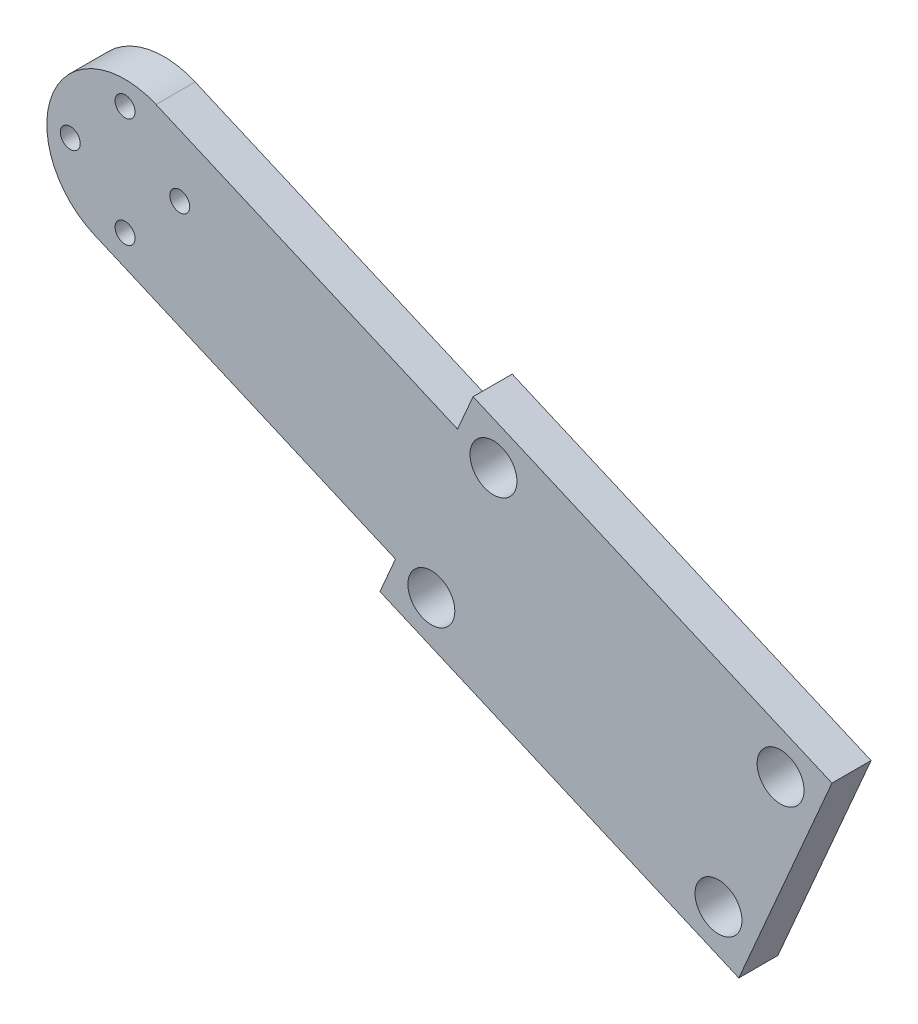
ISO-10303-21;
HEADER;
FILE_DESCRIPTION(('STEP AP214'),'2;1');
FILE_NAME('part.step','',(''),(''),'','','');
FILE_SCHEMA(('AUTOMOTIVE_DESIGN { 1 0 10303 214 1 1 1 1 }'));
ENDSEC;
DATA;
#1=APPLICATION_CONTEXT('core data for automotive mechanical design processes');
#2=APPLICATION_PROTOCOL_DEFINITION('international standard','automotive_design',2000,#1);
#3=PRODUCT_CONTEXT('',#1,'mechanical');
#4=PRODUCT('Part','Part','',(#3));
#5=PRODUCT_RELATED_PRODUCT_CATEGORY('part','',(#4));
#6=PRODUCT_DEFINITION_FORMATION('','',#4);
#7=PRODUCT_DEFINITION_CONTEXT('part definition',#1,'design');
#8=PRODUCT_DEFINITION('design','',#6,#7);
#9=PRODUCT_DEFINITION_SHAPE('','',#8);
#10=(LENGTH_UNIT() NAMED_UNIT(*) SI_UNIT(.MILLI.,.METRE.));
#11=(NAMED_UNIT(*) PLANE_ANGLE_UNIT() SI_UNIT($,.RADIAN.));
#12=(NAMED_UNIT(*) SI_UNIT($,.STERADIAN.) SOLID_ANGLE_UNIT());
#13=UNCERTAINTY_MEASURE_WITH_UNIT(LENGTH_MEASURE(1.E-05),#10,'distance_accuracy_value','');
#14=(GEOMETRIC_REPRESENTATION_CONTEXT(3) GLOBAL_UNCERTAINTY_ASSIGNED_CONTEXT((#13)) GLOBAL_UNIT_ASSIGNED_CONTEXT((#10,
#11,#12)) REPRESENTATION_CONTEXT('',''));
#15=CARTESIAN_POINT('',(0.,0.,0.));
#16=DIRECTION('',(0.,0.,1.));
#17=DIRECTION('',(1.,0.,0.));
#18=AXIS2_PLACEMENT_3D('',#15,#16,#17);
#19=CARTESIAN_POINT('',(0.,0.,5.));
#20=DIRECTION('',(0.,0.,1.));
#21=DIRECTION('',(1.,0.,0.));
#22=AXIS2_PLACEMENT_3D('',#19,#20,#21);
#23=PLANE('',#22);
#24=CARTESIAN_POINT('',(47.1078877864217,-9.47876090540768,5.));
#25=DIRECTION('',(0.,0.,1.));
#26=DIRECTION('',(1.,0.,0.));
#27=AXIS2_PLACEMENT_3D('',#24,#25,#26);
#28=CIRCLE('',#27,3.00000000000213);
#29=CARTESIAN_POINT('',(50.1078877864239,-9.47876090540768,5.));
#30=VERTEX_POINT('',#29);
#31=EDGE_CURVE('E211',#30,#30,#28,.T.);
#32=ORIENTED_EDGE('',*,*,#31,.F.);
#33=EDGE_LOOP('',(#32));
#34=FACE_BOUND('',#33,.T.);
#35=CARTESIAN_POINT('',(75.8821241952316,-43.7138791188731,5.));
#36=DIRECTION('',(0.,0.,1.));
#37=DIRECTION('',(1.,0.,0.));
#38=AXIS2_PLACEMENT_3D('',#35,#36,#37);
#39=CIRCLE('',#38,3.00000000000214);
#40=CARTESIAN_POINT('',(78.8821241952337,-43.7138791188731,5.));
#41=VERTEX_POINT('',#40);
#42=EDGE_CURVE('E199',#41,#41,#39,.T.);
#43=ORIENTED_EDGE('',*,*,#42,.F.);
#44=EDGE_LOOP('',(#43));
#45=FACE_BOUND('',#44,.T.);
#46=CARTESIAN_POINT('',(-6.99999999999994,0.,5.));
#47=DIRECTION('',(0.,0.,1.));
#48=DIRECTION('',(1.,0.,0.));
#49=AXIS2_PLACEMENT_3D('',#46,#47,#48);
#50=CIRCLE('',#49,1.275);
#51=CARTESIAN_POINT('',(-5.72499999999994,0.,5.));
#52=VERTEX_POINT('',#51);
#53=EDGE_CURVE('E187',#52,#52,#50,.T.);
#54=ORIENTED_EDGE('',*,*,#53,.F.);
#55=EDGE_LOOP('',(#54));
#56=FACE_BOUND('',#55,.T.);
#57=CARTESIAN_POINT('',(7.00000000000005,0.,5.));
#58=DIRECTION('',(0.,0.,1.));
#59=DIRECTION('',(1.,0.,0.));
#60=AXIS2_PLACEMENT_3D('',#57,#58,#59);
#61=CIRCLE('',#60,1.275);
#62=CARTESIAN_POINT('',(8.27500000000006,0.,5.));
#63=VERTEX_POINT('',#62);
#64=EDGE_CURVE('E133',#63,#63,#61,.T.);
#65=ORIENTED_EDGE('',*,*,#64,.F.);
#66=EDGE_LOOP('',(#65));
#67=FACE_BOUND('',#66,.T.);
#68=DIRECTION('',(-0.396960000181199,-0.917835910310848,0.));
#69=VECTOR('',#68,1.);
#70=CARTESIAN_POINT('',(42.5187082348677,-7.49396090450174,5.));
#71=LINE('',#70,#69);
#72=CARTESIAN_POINT('',(44.5035082357732,-2.9047813529486,5.));
#73=VERTEX_POINT('',#72);
#74=CARTESIAN_POINT('',(42.5187082348677,-7.49396090450174,5.));
#75=VERTEX_POINT('',#74);
#76=EDGE_CURVE('E144',#73,#75,#71,.T.);
#77=ORIENTED_EDGE('',*,*,#76,.T.);
#78=DIRECTION('',(-0.917835910310847,0.396960000181201,0.));
#79=VECTOR('',#78,1.);
#80=CARTESIAN_POINT('',(42.5187082348677,-7.49396090450174,5.));
#81=LINE('',#80,#79);
#82=CARTESIAN_POINT('',(3.96960000181209,9.17835910310869,5.));
#83=VERTEX_POINT('',#82);
#84=EDGE_CURVE('E92',#75,#83,#81,.T.);
#85=ORIENTED_EDGE('',*,*,#84,.T.);
#86=CARTESIAN_POINT('',(0.,0.,5.));
#87=DIRECTION('',(0.,0.,1.));
#88=DIRECTION('',(1.,0.,0.));
#89=AXIS2_PLACEMENT_3D('',#86,#87,#88);
#90=CIRCLE('',#89,10.0000000000002);
#91=CARTESIAN_POINT('',(-3.96960000181208,-9.17835910310866,5.));
#92=VERTEX_POINT('',#91);
#93=EDGE_CURVE('E159',#83,#92,#90,.T.);
#94=ORIENTED_EDGE('',*,*,#93,.T.);
#95=DIRECTION('',(0.917835910310847,-0.3969600001812,0.));
#96=VECTOR('',#95,1.);
#97=CARTESIAN_POINT('',(34.5795082312435,-25.8506791107191,5.));
#98=LINE('',#97,#96);
#99=CARTESIAN_POINT('',(34.5795082312435,-25.8506791107191,5.));
#100=VERTEX_POINT('',#99);
#101=EDGE_CURVE('E172',#92,#100,#98,.T.);
#102=ORIENTED_EDGE('',*,*,#101,.T.);
#103=DIRECTION('',(-0.396960000181198,-0.917835910310848,0.));
#104=VECTOR('',#103,1.);
#105=CARTESIAN_POINT('',(32.594708230338,-30.4398586622722,5.));
#106=LINE('',#105,#104);
#107=CARTESIAN_POINT('',(32.594708230338,-30.4398586622722,5.));
#108=VERTEX_POINT('',#107);
#109=EDGE_CURVE('E111',#100,#108,#106,.T.);
#110=ORIENTED_EDGE('',*,*,#109,.T.);
#111=DIRECTION('',(0.917835910310847,-0.396960000181199,0.));
#112=VECTOR('',#111,1.);
#113=CARTESIAN_POINT('',(32.594708230338,-30.4398586622722,5.));
#114=LINE('',#113,#112);
#115=CARTESIAN_POINT('',(78.4865037458803,-50.2878586713322,5.));
#116=VERTEX_POINT('',#115);
#117=EDGE_CURVE('E105',#108,#116,#114,.T.);
#118=ORIENTED_EDGE('',*,*,#117,.T.);
#119=DIRECTION('',(0.3969600001812,0.917835910310847,0.));
#120=VECTOR('',#119,1.);
#121=CARTESIAN_POINT('',(78.4865037458803,-50.2878586713322,5.));
#122=LINE('',#121,#120);
#123=CARTESIAN_POINT('',(90.3953037513156,-22.7527813620086,5.));
#124=VERTEX_POINT('',#123);
#125=EDGE_CURVE('E109',#116,#124,#122,.T.);
#126=ORIENTED_EDGE('',*,*,#125,.T.);
#127=DIRECTION('',(-0.917835910310847,0.3969600001812,0.));
#128=VECTOR('',#127,1.);
#129=CARTESIAN_POINT('',(44.5035082357732,-2.9047813529486,5.));
#130=LINE('',#129,#128);
#131=EDGE_CURVE('E49',#124,#73,#130,.T.);
#132=ORIENTED_EDGE('',*,*,#131,.T.);
#133=EDGE_LOOP('',(#77,#85,#94,#102,#110,#118,#126,#132));
#134=FACE_BOUND('',#133,.T.);
#135=CARTESIAN_POINT('',(0.,7.,5.));
#136=DIRECTION('',(0.,0.,1.));
#137=DIRECTION('',(1.,0.,0.));
#138=AXIS2_PLACEMENT_3D('',#135,#136,#137);
#139=CIRCLE('',#138,1.275);
#140=CARTESIAN_POINT('',(1.27500000000006,7.,5.));
#141=VERTEX_POINT('',#140);
#142=EDGE_CURVE('E181',#141,#141,#139,.T.);
#143=ORIENTED_EDGE('',*,*,#142,.F.);
#144=EDGE_LOOP('',(#143));
#145=FACE_BOUND('',#144,.T.);
#146=CARTESIAN_POINT('',(0.,-7.,5.));
#147=DIRECTION('',(0.,0.,1.));
#148=DIRECTION('',(1.,0.,0.));
#149=AXIS2_PLACEMENT_3D('',#146,#147,#148);
#150=CIRCLE('',#149,1.275);
#151=CARTESIAN_POINT('',(1.27500000000006,-7.,5.));
#152=VERTEX_POINT('',#151);
#153=EDGE_CURVE('E193',#152,#152,#150,.T.);
#154=ORIENTED_EDGE('',*,*,#153,.F.);
#155=EDGE_LOOP('',(#154));
#156=FACE_BOUND('',#155,.T.);
#157=CARTESIAN_POINT('',(83.8213241988556,-25.3571609126557,5.));
#158=DIRECTION('',(0.,0.,1.));
#159=DIRECTION('',(1.,0.,0.));
#160=AXIS2_PLACEMENT_3D('',#157,#158,#159);
#161=CIRCLE('',#160,3.00000000000214);
#162=CARTESIAN_POINT('',(86.8213241988577,-25.3571609126557,5.));
#163=VERTEX_POINT('',#162);
#164=EDGE_CURVE('E205',#163,#163,#161,.T.);
#165=ORIENTED_EDGE('',*,*,#164,.F.);
#166=EDGE_LOOP('',(#165));
#167=FACE_BOUND('',#166,.T.);
#168=CARTESIAN_POINT('',(39.1686877827977,-27.8354791116251,5.));
#169=DIRECTION('',(0.,0.,1.));
#170=DIRECTION('',(1.,0.,0.));
#171=AXIS2_PLACEMENT_3D('',#168,#169,#170);
#172=CIRCLE('',#171,3.00000000000214);
#173=CARTESIAN_POINT('',(42.1686877827998,-27.8354791116251,5.));
#174=VERTEX_POINT('',#173);
#175=EDGE_CURVE('E217',#174,#174,#172,.T.);
#176=ORIENTED_EDGE('',*,*,#175,.F.);
#177=EDGE_LOOP('',(#176));
#178=FACE_BOUND('',#177,.T.);
#179=ADVANCED_FACE('F32',(#34,#45,#56,#67,#134,#145,#156,#167,#178),#23,.T.);
#180=CARTESIAN_POINT('',(0.,0.,0.));
#181=DIRECTION('',(0.,0.,1.));
#182=DIRECTION('',(1.,0.,0.));
#183=AXIS2_PLACEMENT_3D('',#180,#181,#182);
#184=PLANE('',#183);
#185=DIRECTION('',(-0.396960000181199,-0.917835910310848,0.));
#186=VECTOR('',#185,1.);
#187=CARTESIAN_POINT('',(42.5187082348677,-7.49396090450174,0.));
#188=LINE('',#187,#186);
#189=CARTESIAN_POINT('',(44.5035082357732,-2.9047813529486,0.));
#190=VERTEX_POINT('',#189);
#191=CARTESIAN_POINT('',(42.5187082348677,-7.49396090450174,0.));
#192=VERTEX_POINT('',#191);
#193=EDGE_CURVE('E129',#190,#192,#188,.T.);
#194=ORIENTED_EDGE('',*,*,#193,.F.);
#195=DIRECTION('',(-0.917835910310847,0.3969600001812,0.));
#196=VECTOR('',#195,1.);
#197=CARTESIAN_POINT('',(44.5035082357732,-2.9047813529486,0.));
#198=LINE('',#197,#196);
#199=CARTESIAN_POINT('',(90.3953037513156,-22.7527813620086,0.));
#200=VERTEX_POINT('',#199);
#201=EDGE_CURVE('E84',#200,#190,#198,.T.);
#202=ORIENTED_EDGE('',*,*,#201,.F.);
#203=DIRECTION('',(0.3969600001812,0.917835910310847,0.));
#204=VECTOR('',#203,1.);
#205=CARTESIAN_POINT('',(78.4865037458803,-50.2878586713322,0.));
#206=LINE('',#205,#204);
#207=CARTESIAN_POINT('',(78.4865037458803,-50.2878586713322,0.));
#208=VERTEX_POINT('',#207);
#209=EDGE_CURVE('E78',#208,#200,#206,.T.);
#210=ORIENTED_EDGE('',*,*,#209,.F.);
#211=DIRECTION('',(0.917835910310847,-0.396960000181199,0.));
#212=VECTOR('',#211,1.);
#213=CARTESIAN_POINT('',(32.594708230338,-30.4398586622722,0.));
#214=LINE('',#213,#212);
#215=CARTESIAN_POINT('',(32.594708230338,-30.4398586622722,0.));
#216=VERTEX_POINT('',#215);
#217=EDGE_CURVE('E119',#216,#208,#214,.T.);
#218=ORIENTED_EDGE('',*,*,#217,.F.);
#219=DIRECTION('',(-0.396960000181198,-0.917835910310848,0.));
#220=VECTOR('',#219,1.);
#221=CARTESIAN_POINT('',(32.594708230338,-30.4398586622722,0.));
#222=LINE('',#221,#220);
#223=CARTESIAN_POINT('',(34.5795082312435,-25.8506791107191,0.));
#224=VERTEX_POINT('',#223);
#225=EDGE_CURVE('E139',#224,#216,#222,.T.);
#226=ORIENTED_EDGE('',*,*,#225,.F.);
#227=DIRECTION('',(0.917835910310847,-0.3969600001812,0.));
#228=VECTOR('',#227,1.);
#229=CARTESIAN_POINT('',(34.5795082312435,-25.8506791107191,0.));
#230=LINE('',#229,#228);
#231=CARTESIAN_POINT('',(-3.96960000181208,-9.17835910310866,0.));
#232=VERTEX_POINT('',#231);
#233=EDGE_CURVE('E137',#232,#224,#230,.T.);
#234=ORIENTED_EDGE('',*,*,#233,.F.);
#235=CARTESIAN_POINT('',(0.,0.,0.));
#236=DIRECTION('',(0.,0.,1.));
#237=DIRECTION('',(1.,0.,0.));
#238=AXIS2_PLACEMENT_3D('',#235,#236,#237);
#239=CIRCLE('',#238,10.0000000000002);
#240=CARTESIAN_POINT('',(3.96960000181209,9.17835910310869,0.));
#241=VERTEX_POINT('',#240);
#242=EDGE_CURVE('E135',#241,#232,#239,.T.);
#243=ORIENTED_EDGE('',*,*,#242,.F.);
#244=DIRECTION('',(-0.917835910310847,0.396960000181201,0.));
#245=VECTOR('',#244,1.);
#246=CARTESIAN_POINT('',(42.5187082348677,-7.49396090450174,0.));
#247=LINE('',#246,#245);
#248=EDGE_CURVE('E132',#192,#241,#247,.T.);
#249=ORIENTED_EDGE('',*,*,#248,.F.);
#250=EDGE_LOOP('',(#194,#202,#210,#218,#226,#234,#243,#249));
#251=FACE_BOUND('',#250,.T.);
#252=CARTESIAN_POINT('',(7.00000000000005,0.,0.));
#253=DIRECTION('',(0.,0.,1.));
#254=DIRECTION('',(1.,0.,0.));
#255=AXIS2_PLACEMENT_3D('',#252,#253,#254);
#256=CIRCLE('',#255,1.275);
#257=CARTESIAN_POINT('',(8.27500000000006,0.,0.));
#258=VERTEX_POINT('',#257);
#259=EDGE_CURVE('E178',#258,#258,#256,.T.);
#260=ORIENTED_EDGE('',*,*,#259,.T.);
#261=EDGE_LOOP('',(#260));
#262=FACE_BOUND('',#261,.T.);
#263=CARTESIAN_POINT('',(0.,7.,0.));
#264=DIRECTION('',(0.,0.,1.));
#265=DIRECTION('',(1.,0.,0.));
#266=AXIS2_PLACEMENT_3D('',#263,#264,#265);
#267=CIRCLE('',#266,1.275);
#268=CARTESIAN_POINT('',(1.27500000000006,7.,0.));
#269=VERTEX_POINT('',#268);
#270=EDGE_CURVE('E184',#269,#269,#267,.T.);
#271=ORIENTED_EDGE('',*,*,#270,.T.);
#272=EDGE_LOOP('',(#271));
#273=FACE_BOUND('',#272,.T.);
#274=CARTESIAN_POINT('',(-6.99999999999994,0.,0.));
#275=DIRECTION('',(0.,0.,1.));
#276=DIRECTION('',(1.,0.,0.));
#277=AXIS2_PLACEMENT_3D('',#274,#275,#276);
#278=CIRCLE('',#277,1.275);
#279=CARTESIAN_POINT('',(-5.72499999999994,0.,0.));
#280=VERTEX_POINT('',#279);
#281=EDGE_CURVE('E190',#280,#280,#278,.T.);
#282=ORIENTED_EDGE('',*,*,#281,.T.);
#283=EDGE_LOOP('',(#282));
#284=FACE_BOUND('',#283,.T.);
#285=CARTESIAN_POINT('',(0.,-7.,0.));
#286=DIRECTION('',(0.,0.,1.));
#287=DIRECTION('',(1.,0.,0.));
#288=AXIS2_PLACEMENT_3D('',#285,#286,#287);
#289=CIRCLE('',#288,1.275);
#290=CARTESIAN_POINT('',(1.27500000000006,-7.,0.));
#291=VERTEX_POINT('',#290);
#292=EDGE_CURVE('E196',#291,#291,#289,.T.);
#293=ORIENTED_EDGE('',*,*,#292,.T.);
#294=EDGE_LOOP('',(#293));
#295=FACE_BOUND('',#294,.T.);
#296=CARTESIAN_POINT('',(75.8821241952316,-43.7138791188731,0.));
#297=DIRECTION('',(0.,0.,1.));
#298=DIRECTION('',(1.,0.,0.));
#299=AXIS2_PLACEMENT_3D('',#296,#297,#298);
#300=CIRCLE('',#299,3.00000000000214);
#301=CARTESIAN_POINT('',(78.8821241952337,-43.7138791188731,0.));
#302=VERTEX_POINT('',#301);
#303=EDGE_CURVE('E202',#302,#302,#300,.T.);
#304=ORIENTED_EDGE('',*,*,#303,.T.);
#305=EDGE_LOOP('',(#304));
#306=FACE_BOUND('',#305,.T.);
#307=CARTESIAN_POINT('',(83.8213241988556,-25.3571609126557,0.));
#308=DIRECTION('',(0.,0.,1.));
#309=DIRECTION('',(1.,0.,0.));
#310=AXIS2_PLACEMENT_3D('',#307,#308,#309);
#311=CIRCLE('',#310,3.00000000000214);
#312=CARTESIAN_POINT('',(86.8213241988577,-25.3571609126557,0.));
#313=VERTEX_POINT('',#312);
#314=EDGE_CURVE('E208',#313,#313,#311,.T.);
#315=ORIENTED_EDGE('',*,*,#314,.T.);
#316=EDGE_LOOP('',(#315));
#317=FACE_BOUND('',#316,.T.);
#318=CARTESIAN_POINT('',(47.1078877864217,-9.47876090540768,0.));
#319=DIRECTION('',(0.,0.,1.));
#320=DIRECTION('',(1.,0.,0.));
#321=AXIS2_PLACEMENT_3D('',#318,#319,#320);
#322=CIRCLE('',#321,3.00000000000213);
#323=CARTESIAN_POINT('',(50.1078877864239,-9.47876090540768,0.));
#324=VERTEX_POINT('',#323);
#325=EDGE_CURVE('E214',#324,#324,#322,.T.);
#326=ORIENTED_EDGE('',*,*,#325,.T.);
#327=EDGE_LOOP('',(#326));
#328=FACE_BOUND('',#327,.T.);
#329=CARTESIAN_POINT('',(39.1686877827977,-27.8354791116251,0.));
#330=DIRECTION('',(0.,0.,1.));
#331=DIRECTION('',(1.,0.,0.));
#332=AXIS2_PLACEMENT_3D('',#329,#330,#331);
#333=CIRCLE('',#332,3.00000000000214);
#334=CARTESIAN_POINT('',(42.1686877827998,-27.8354791116251,0.));
#335=VERTEX_POINT('',#334);
#336=EDGE_CURVE('E220',#335,#335,#333,.T.);
#337=ORIENTED_EDGE('',*,*,#336,.T.);
#338=EDGE_LOOP('',(#337));
#339=FACE_BOUND('',#338,.T.);
#340=ADVANCED_FACE('F163',(#251,#262,#273,#284,#295,#306,#317,#328,#339),#184,.F.);
#341=CARTESIAN_POINT('',(42.5187082348677,-7.49396090450174,5.));
#342=DIRECTION('',(0.917835910310848,-0.396960000181199,0.));
#343=DIRECTION('',(0.396960000181199,0.917835910310848,0.));
#344=AXIS2_PLACEMENT_3D('',#341,#342,#343);
#345=PLANE('',#344);
#346=ORIENTED_EDGE('',*,*,#193,.T.);
#347=DIRECTION('',(0.,0.,-1.));
#348=VECTOR('',#347,1.);
#349=CARTESIAN_POINT('',(42.5187082348677,-7.49396090450174,5.));
#350=LINE('',#349,#348);
#351=EDGE_CURVE('E11',#75,#192,#350,.T.);
#352=ORIENTED_EDGE('',*,*,#351,.F.);
#353=ORIENTED_EDGE('',*,*,#76,.F.);
#354=DIRECTION('',(0.,0.,-1.));
#355=VECTOR('',#354,1.);
#356=CARTESIAN_POINT('',(44.5035082357732,-2.9047813529486,5.));
#357=LINE('',#356,#355);
#358=EDGE_CURVE('E125',#73,#190,#357,.T.);
#359=ORIENTED_EDGE('',*,*,#358,.T.);
#360=EDGE_LOOP('',(#346,#352,#353,#359));
#361=FACE_BOUND('',#360,.T.);
#362=ADVANCED_FACE('F34',(#361),#345,.F.);
#363=CARTESIAN_POINT('',(42.5187082348677,-7.49396090450174,5.));
#364=DIRECTION('',(-0.396960000181201,-0.917835910310847,0.));
#365=DIRECTION('',(0.917835910310847,-0.396960000181201,0.));
#366=AXIS2_PLACEMENT_3D('',#363,#364,#365);
#367=PLANE('',#366);
#368=ORIENTED_EDGE('',*,*,#248,.T.);
#369=DIRECTION('',(0.,0.,-1.));
#370=VECTOR('',#369,1.);
#371=CARTESIAN_POINT('',(3.96960000181209,9.17835910310869,5.));
#372=LINE('',#371,#370);
#373=EDGE_CURVE('E41',#83,#241,#372,.T.);
#374=ORIENTED_EDGE('',*,*,#373,.F.);
#375=ORIENTED_EDGE('',*,*,#84,.F.);
#376=ORIENTED_EDGE('',*,*,#351,.T.);
#377=EDGE_LOOP('',(#368,#374,#375,#376));
#378=FACE_BOUND('',#377,.T.);
#379=ADVANCED_FACE('F254',(#378),#367,.F.);
#380=CARTESIAN_POINT('',(0.,0.,5.));
#381=DIRECTION('',(0.,0.,-1.));
#382=DIRECTION('',(-1.,0.,0.));
#383=AXIS2_PLACEMENT_3D('',#380,#381,#382);
#384=CYLINDRICAL_SURFACE('',#383,10.0000000000002);
#385=ORIENTED_EDGE('',*,*,#242,.T.);
#386=DIRECTION('',(0.,0.,-1.));
#387=VECTOR('',#386,1.);
#388=CARTESIAN_POINT('',(-3.96960000181208,-9.17835910310866,5.));
#389=LINE('',#388,#387);
#390=EDGE_CURVE('E151',#92,#232,#389,.T.);
#391=ORIENTED_EDGE('',*,*,#390,.F.);
#392=ORIENTED_EDGE('',*,*,#93,.F.);
#393=ORIENTED_EDGE('',*,*,#373,.T.);
#394=EDGE_LOOP('',(#385,#391,#392,#393));
#395=FACE_BOUND('',#394,.T.);
#396=ADVANCED_FACE('F157',(#395),#384,.T.);
#397=CARTESIAN_POINT('',(34.5795082312435,-25.8506791107191,5.));
#398=DIRECTION('',(0.3969600001812,0.917835910310847,0.));
#399=DIRECTION('',(-0.917835910310847,0.3969600001812,0.));
#400=AXIS2_PLACEMENT_3D('',#397,#398,#399);
#401=PLANE('',#400);
#402=ORIENTED_EDGE('',*,*,#233,.T.);
#403=DIRECTION('',(0.,0.,-1.));
#404=VECTOR('',#403,1.);
#405=CARTESIAN_POINT('',(34.5795082312435,-25.8506791107191,5.));
#406=LINE('',#405,#404);
#407=EDGE_CURVE('E148',#100,#224,#406,.T.);
#408=ORIENTED_EDGE('',*,*,#407,.F.);
#409=ORIENTED_EDGE('',*,*,#101,.F.);
#410=ORIENTED_EDGE('',*,*,#390,.T.);
#411=EDGE_LOOP('',(#402,#408,#409,#410));
#412=FACE_BOUND('',#411,.T.);
#413=ADVANCED_FACE('F168',(#412),#401,.F.);
#414=CARTESIAN_POINT('',(32.594708230338,-30.4398586622722,5.));
#415=DIRECTION('',(0.917835910310848,-0.396960000181198,0.));
#416=DIRECTION('',(0.396960000181198,0.917835910310848,0.));
#417=AXIS2_PLACEMENT_3D('',#414,#415,#416);
#418=PLANE('',#417);
#419=ORIENTED_EDGE('',*,*,#225,.T.);
#420=DIRECTION('',(0.,0.,-1.));
#421=VECTOR('',#420,1.);
#422=CARTESIAN_POINT('',(32.594708230338,-30.4398586622722,5.));
#423=LINE('',#422,#421);
#424=EDGE_CURVE('E120',#108,#216,#423,.T.);
#425=ORIENTED_EDGE('',*,*,#424,.F.);
#426=ORIENTED_EDGE('',*,*,#109,.F.);
#427=ORIENTED_EDGE('',*,*,#407,.T.);
#428=EDGE_LOOP('',(#419,#425,#426,#427));
#429=FACE_BOUND('',#428,.T.);
#430=ADVANCED_FACE('F171',(#429),#418,.F.);
#431=CARTESIAN_POINT('',(32.594708230338,-30.4398586622722,5.));
#432=DIRECTION('',(0.396960000181199,0.917835910310848,0.));
#433=DIRECTION('',(-0.917835910310848,0.396960000181199,0.));
#434=AXIS2_PLACEMENT_3D('',#431,#432,#433);
#435=PLANE('',#434);
#436=ORIENTED_EDGE('',*,*,#217,.T.);
#437=DIRECTION('',(0.,0.,-1.));
#438=VECTOR('',#437,1.);
#439=CARTESIAN_POINT('',(78.4865037458803,-50.2878586713322,5.));
#440=LINE('',#439,#438);
#441=EDGE_CURVE('E116',#116,#208,#440,.T.);
#442=ORIENTED_EDGE('',*,*,#441,.F.);
#443=ORIENTED_EDGE('',*,*,#117,.F.);
#444=ORIENTED_EDGE('',*,*,#424,.T.);
#445=EDGE_LOOP('',(#436,#442,#443,#444));
#446=FACE_BOUND('',#445,.T.);
#447=ADVANCED_FACE('F117',(#446),#435,.F.);
#448=CARTESIAN_POINT('',(78.4865037458803,-50.2878586713322,5.));
#449=DIRECTION('',(-0.917835910310847,0.3969600001812,0.));
#450=DIRECTION('',(-0.3969600001812,-0.917835910310847,0.));
#451=AXIS2_PLACEMENT_3D('',#448,#449,#450);
#452=PLANE('',#451);
#453=ORIENTED_EDGE('',*,*,#209,.T.);
#454=DIRECTION('',(0.,0.,-1.));
#455=VECTOR('',#454,1.);
#456=CARTESIAN_POINT('',(90.3953037513156,-22.7527813620086,5.));
#457=LINE('',#456,#455);
#458=EDGE_CURVE('E121',#124,#200,#457,.T.);
#459=ORIENTED_EDGE('',*,*,#458,.F.);
#460=ORIENTED_EDGE('',*,*,#125,.F.);
#461=ORIENTED_EDGE('',*,*,#441,.T.);
#462=EDGE_LOOP('',(#453,#459,#460,#461));
#463=FACE_BOUND('',#462,.T.);
#464=ADVANCED_FACE('F123',(#463),#452,.F.);
#465=CARTESIAN_POINT('',(44.5035082357732,-2.9047813529486,5.));
#466=DIRECTION('',(-0.3969600001812,-0.917835910310847,0.));
#467=DIRECTION('',(0.917835910310847,-0.3969600001812,0.));
#468=AXIS2_PLACEMENT_3D('',#465,#466,#467);
#469=PLANE('',#468);
#470=ORIENTED_EDGE('',*,*,#201,.T.);
#471=ORIENTED_EDGE('',*,*,#358,.F.);
#472=ORIENTED_EDGE('',*,*,#131,.F.);
#473=ORIENTED_EDGE('',*,*,#458,.T.);
#474=EDGE_LOOP('',(#470,#471,#472,#473));
#475=FACE_BOUND('',#474,.T.);
#476=ADVANCED_FACE('F242',(#475),#469,.F.);
#477=CARTESIAN_POINT('',(7.00000000000005,0.,5.));
#478=DIRECTION('',(0.,0.,-1.));
#479=DIRECTION('',(-1.,0.,0.));
#480=AXIS2_PLACEMENT_3D('',#477,#478,#479);
#481=CYLINDRICAL_SURFACE('',#480,1.275);
#482=ORIENTED_EDGE('',*,*,#64,.T.);
#483=EDGE_LOOP('',(#482));
#484=FACE_BOUND('',#483,.T.);
#485=ORIENTED_EDGE('',*,*,#259,.F.);
#486=EDGE_LOOP('',(#485));
#487=FACE_BOUND('',#486,.T.);
#488=ADVANCED_FACE('F239',(#484,#487),#481,.F.);
#489=CARTESIAN_POINT('',(0.,7.,5.));
#490=DIRECTION('',(0.,0.,-1.));
#491=DIRECTION('',(-1.,0.,0.));
#492=AXIS2_PLACEMENT_3D('',#489,#490,#491);
#493=CYLINDRICAL_SURFACE('',#492,1.275);
#494=ORIENTED_EDGE('',*,*,#142,.T.);
#495=EDGE_LOOP('',(#494));
#496=FACE_BOUND('',#495,.T.);
#497=ORIENTED_EDGE('',*,*,#270,.F.);
#498=EDGE_LOOP('',(#497));
#499=FACE_BOUND('',#498,.T.);
#500=ADVANCED_FACE('F318',(#496,#499),#493,.F.);
#501=CARTESIAN_POINT('',(-6.99999999999994,0.,5.));
#502=DIRECTION('',(0.,0.,-1.));
#503=DIRECTION('',(-1.,0.,0.));
#504=AXIS2_PLACEMENT_3D('',#501,#502,#503);
#505=CYLINDRICAL_SURFACE('',#504,1.275);
#506=ORIENTED_EDGE('',*,*,#53,.T.);
#507=EDGE_LOOP('',(#506));
#508=FACE_BOUND('',#507,.T.);
#509=ORIENTED_EDGE('',*,*,#281,.F.);
#510=EDGE_LOOP('',(#509));
#511=FACE_BOUND('',#510,.T.);
#512=ADVANCED_FACE('F326',(#508,#511),#505,.F.);
#513=CARTESIAN_POINT('',(0.,-7.,5.));
#514=DIRECTION('',(0.,0.,-1.));
#515=DIRECTION('',(-1.,0.,0.));
#516=AXIS2_PLACEMENT_3D('',#513,#514,#515);
#517=CYLINDRICAL_SURFACE('',#516,1.275);
#518=ORIENTED_EDGE('',*,*,#153,.T.);
#519=EDGE_LOOP('',(#518));
#520=FACE_BOUND('',#519,.T.);
#521=ORIENTED_EDGE('',*,*,#292,.F.);
#522=EDGE_LOOP('',(#521));
#523=FACE_BOUND('',#522,.T.);
#524=ADVANCED_FACE('F334',(#520,#523),#517,.F.);
#525=CARTESIAN_POINT('',(75.8821241952316,-43.7138791188731,5.));
#526=DIRECTION('',(0.,0.,-1.));
#527=DIRECTION('',(-1.,0.,0.));
#528=AXIS2_PLACEMENT_3D('',#525,#526,#527);
#529=CYLINDRICAL_SURFACE('',#528,3.00000000000214);
#530=ORIENTED_EDGE('',*,*,#42,.T.);
#531=EDGE_LOOP('',(#530));
#532=FACE_BOUND('',#531,.T.);
#533=ORIENTED_EDGE('',*,*,#303,.F.);
#534=EDGE_LOOP('',(#533));
#535=FACE_BOUND('',#534,.T.);
#536=ADVANCED_FACE('F343',(#532,#535),#529,.F.);
#537=CARTESIAN_POINT('',(83.8213241988556,-25.3571609126557,5.));
#538=DIRECTION('',(0.,0.,-1.));
#539=DIRECTION('',(-1.,0.,0.));
#540=AXIS2_PLACEMENT_3D('',#537,#538,#539);
#541=CYLINDRICAL_SURFACE('',#540,3.00000000000214);
#542=ORIENTED_EDGE('',*,*,#164,.T.);
#543=EDGE_LOOP('',(#542));
#544=FACE_BOUND('',#543,.T.);
#545=ORIENTED_EDGE('',*,*,#314,.F.);
#546=EDGE_LOOP('',(#545));
#547=FACE_BOUND('',#546,.T.);
#548=ADVANCED_FACE('F352',(#544,#547),#541,.F.);
#549=CARTESIAN_POINT('',(47.1078877864217,-9.47876090540768,5.));
#550=DIRECTION('',(0.,0.,-1.));
#551=DIRECTION('',(-1.,0.,0.));
#552=AXIS2_PLACEMENT_3D('',#549,#550,#551);
#553=CYLINDRICAL_SURFACE('',#552,3.00000000000213);
#554=ORIENTED_EDGE('',*,*,#31,.T.);
#555=EDGE_LOOP('',(#554));
#556=FACE_BOUND('',#555,.T.);
#557=ORIENTED_EDGE('',*,*,#325,.F.);
#558=EDGE_LOOP('',(#557));
#559=FACE_BOUND('',#558,.T.);
#560=ADVANCED_FACE('F361',(#556,#559),#553,.F.);
#561=CARTESIAN_POINT('',(39.1686877827977,-27.8354791116251,5.));
#562=DIRECTION('',(0.,0.,-1.));
#563=DIRECTION('',(-1.,0.,0.));
#564=AXIS2_PLACEMENT_3D('',#561,#562,#563);
#565=CYLINDRICAL_SURFACE('',#564,3.00000000000214);
#566=ORIENTED_EDGE('',*,*,#175,.T.);
#567=EDGE_LOOP('',(#566));
#568=FACE_BOUND('',#567,.T.);
#569=ORIENTED_EDGE('',*,*,#336,.F.);
#570=EDGE_LOOP('',(#569));
#571=FACE_BOUND('',#570,.T.);
#572=ADVANCED_FACE('F226',(#568,#571),#565,.F.);
#573=CLOSED_SHELL('',(#179,#340,#362,#379,#396,#413,#430,#447,#464,#476,#488,#500,#512,#524,
#536,#548,#560,#572));
#574=MANIFOLD_SOLID_BREP('B2',#573);
#575=ADVANCED_BREP_SHAPE_REPRESENTATION('',(#18,#574),#14);
#576=SHAPE_DEFINITION_REPRESENTATION(#9,#575);
ENDSEC;
END-ISO-10303-21;
